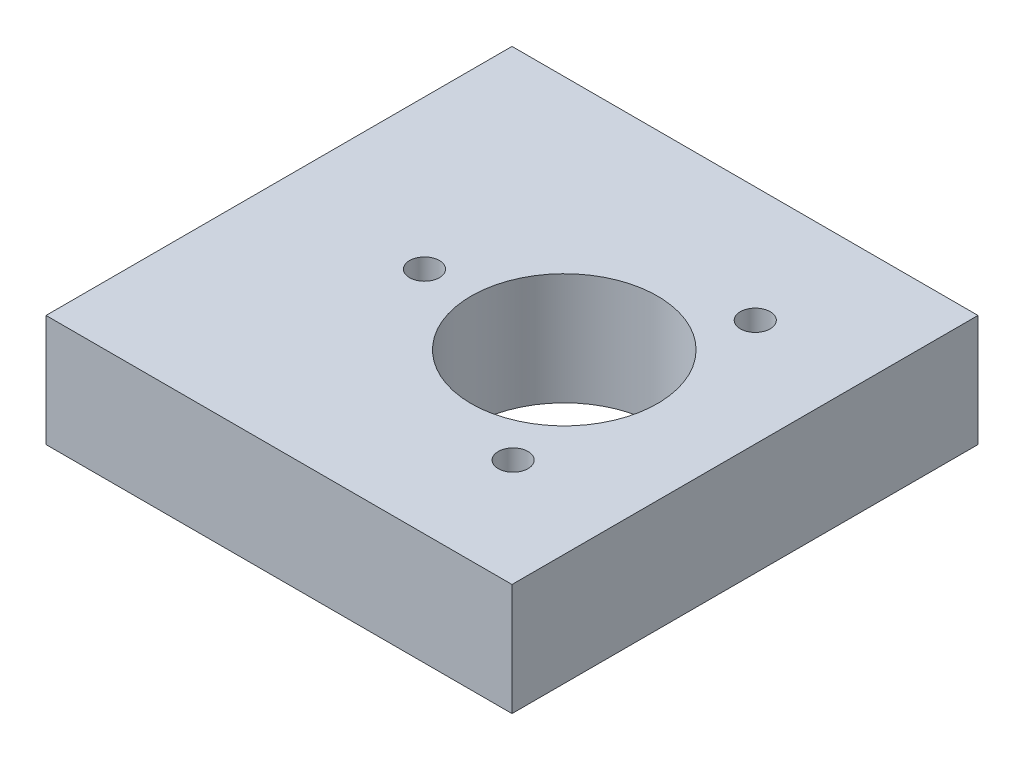
ISO-10303-21;
HEADER;
FILE_DESCRIPTION(('STEP AP214'),'2;1');
FILE_NAME('part.step','',(''),(''),'','','');
FILE_SCHEMA(('AUTOMOTIVE_DESIGN { 1 0 10303 214 1 1 1 1 }'));
ENDSEC;
DATA;
#1=APPLICATION_CONTEXT('core data for automotive mechanical design processes');
#2=APPLICATION_PROTOCOL_DEFINITION('international standard','automotive_design',2000,#1);
#3=PRODUCT_CONTEXT('',#1,'mechanical');
#4=PRODUCT('Part','Part','',(#3));
#5=PRODUCT_RELATED_PRODUCT_CATEGORY('part','',(#4));
#6=PRODUCT_DEFINITION_FORMATION('','',#4);
#7=PRODUCT_DEFINITION_CONTEXT('part definition',#1,'design');
#8=PRODUCT_DEFINITION('design','',#6,#7);
#9=PRODUCT_DEFINITION_SHAPE('','',#8);
#10=(LENGTH_UNIT() NAMED_UNIT(*) SI_UNIT(.MILLI.,.METRE.));
#11=(NAMED_UNIT(*) PLANE_ANGLE_UNIT() SI_UNIT($,.RADIAN.));
#12=(NAMED_UNIT(*) SI_UNIT($,.STERADIAN.) SOLID_ANGLE_UNIT());
#13=UNCERTAINTY_MEASURE_WITH_UNIT(LENGTH_MEASURE(1.E-05),#10,'distance_accuracy_value','');
#14=(GEOMETRIC_REPRESENTATION_CONTEXT(3) GLOBAL_UNCERTAINTY_ASSIGNED_CONTEXT((#13)) GLOBAL_UNIT_ASSIGNED_CONTEXT((#10,
#11,#12)) REPRESENTATION_CONTEXT('',''));
#15=CARTESIAN_POINT('',(0.,0.,0.));
#16=DIRECTION('',(0.,0.,1.));
#17=DIRECTION('',(1.,0.,0.));
#18=AXIS2_PLACEMENT_3D('',#15,#16,#17);
#19=CARTESIAN_POINT('',(-26.4741424256875,-1.92570497536162,50.));
#20=DIRECTION('',(1.,0.,0.));
#21=DIRECTION('',(0.,1.,0.));
#22=AXIS2_PLACEMENT_3D('',#19,#20,#21);
#23=PLANE('',#22);
#24=DIRECTION('',(0.,-1.,0.));
#25=VECTOR('',#24,1.);
#26=CARTESIAN_POINT('',(-26.4741424256875,-1.92570497536162,0.));
#27=LINE('',#26,#25);
#28=CARTESIAN_POINT('',(-26.4741424256875,-1.92570497536162,0.));
#29=VERTEX_POINT('',#28);
#30=CARTESIAN_POINT('',(-26.4741424256875,-13.9257049753616,0.));
#31=VERTEX_POINT('',#30);
#32=EDGE_CURVE('E129',#29,#31,#27,.T.);
#33=ORIENTED_EDGE('',*,*,#32,.T.);
#34=DIRECTION('',(0.,0.,-1.));
#35=VECTOR('',#34,1.);
#36=CARTESIAN_POINT('',(-26.4741424256875,-13.9257049753616,50.));
#37=LINE('',#36,#35);
#38=CARTESIAN_POINT('',(-26.4741424256875,-13.9257049753616,50.));
#39=VERTEX_POINT('',#38);
#40=EDGE_CURVE('E11',#39,#31,#37,.T.);
#41=ORIENTED_EDGE('',*,*,#40,.F.);
#42=DIRECTION('',(0.,-1.,0.));
#43=VECTOR('',#42,1.);
#44=CARTESIAN_POINT('',(-26.4741424256875,-1.92570497536162,50.));
#45=LINE('',#44,#43);
#46=CARTESIAN_POINT('',(-26.4741424256875,-1.92570497536162,50.));
#47=VERTEX_POINT('',#46);
#48=EDGE_CURVE('E130',#47,#39,#45,.T.);
#49=ORIENTED_EDGE('',*,*,#48,.F.);
#50=DIRECTION('',(0.,0.,-1.));
#51=VECTOR('',#50,1.);
#52=CARTESIAN_POINT('',(-26.4741424256875,-1.92570497536162,50.));
#53=LINE('',#52,#51);
#54=EDGE_CURVE('E140',#47,#29,#53,.T.);
#55=ORIENTED_EDGE('',*,*,#54,.T.);
#56=EDGE_LOOP('',(#33,#41,#49,#55));
#57=FACE_BOUND('',#56,.T.);
#58=ADVANCED_FACE('F44',(#57),#23,.F.);
#59=CARTESIAN_POINT('',(-26.4741424256875,-13.9257049753616,50.));
#60=DIRECTION('',(0.,1.,0.));
#61=DIRECTION('',(0.,0.,1.));
#62=AXIS2_PLACEMENT_3D('',#59,#60,#61);
#63=PLANE('',#62);
#64=CARTESIAN_POINT('',(-10.4741424256875,-13.9257049753616,25.3894452392306));
#65=DIRECTION('',(0.,1.,0.));
#66=DIRECTION('',(0.,0.,1.));
#67=AXIS2_PLACEMENT_3D('',#64,#65,#66);
#68=CIRCLE('',#67,1.6);
#69=CARTESIAN_POINT('',(-10.4741424256875,-13.9257049753616,26.9894452392306));
#70=VERTEX_POINT('',#69);
#71=EDGE_CURVE('E122',#70,#70,#68,.T.);
#72=ORIENTED_EDGE('',*,*,#71,.T.);
#73=EDGE_LOOP('',(#72));
#74=FACE_BOUND('',#73,.T.);
#75=CARTESIAN_POINT('',(12.0258575743125,-13.9257049753616,38.3798262959972));
#76=DIRECTION('',(0.,1.,0.));
#77=DIRECTION('',(0.,0.,1.));
#78=AXIS2_PLACEMENT_3D('',#75,#76,#77);
#79=CIRCLE('',#78,1.6);
#80=CARTESIAN_POINT('',(12.0258575743125,-13.9257049753616,39.9798262959972));
#81=VERTEX_POINT('',#80);
#82=EDGE_CURVE('E193',#81,#81,#79,.T.);
#83=ORIENTED_EDGE('',*,*,#82,.T.);
#84=EDGE_LOOP('',(#83));
#85=FACE_BOUND('',#84,.T.);
#86=CARTESIAN_POINT('',(12.0258575743125,-13.9257049753616,12.399064182464));
#87=DIRECTION('',(0.,1.,0.));
#88=DIRECTION('',(0.,0.,1.));
#89=AXIS2_PLACEMENT_3D('',#86,#87,#88);
#90=CIRCLE('',#89,1.6);
#91=CARTESIAN_POINT('',(12.0258575743125,-13.9257049753616,13.999064182464));
#92=VERTEX_POINT('',#91);
#93=EDGE_CURVE('E197',#92,#92,#90,.T.);
#94=ORIENTED_EDGE('',*,*,#93,.T.);
#95=EDGE_LOOP('',(#94));
#96=FACE_BOUND('',#95,.T.);
#97=CARTESIAN_POINT('',(4.52585757431251,-13.9257049753616,25.3894452392306));
#98=DIRECTION('',(0.,1.,0.));
#99=DIRECTION('',(0.,0.,1.));
#100=AXIS2_PLACEMENT_3D('',#97,#98,#99);
#101=CIRCLE('',#100,10.);
#102=CARTESIAN_POINT('',(4.52585757431251,-13.9257049753616,35.3894452392306));
#103=VERTEX_POINT('',#102);
#104=EDGE_CURVE('E200',#103,#103,#101,.T.);
#105=ORIENTED_EDGE('',*,*,#104,.T.);
#106=EDGE_LOOP('',(#105));
#107=FACE_BOUND('',#106,.T.);
#108=DIRECTION('',(1.,0.,0.));
#109=VECTOR('',#108,1.);
#110=CARTESIAN_POINT('',(-26.4741424256875,-13.9257049753616,0.));
#111=LINE('',#110,#109);
#112=CARTESIAN_POINT('',(23.5258575743125,-13.9257049753616,0.));
#113=VERTEX_POINT('',#112);
#114=EDGE_CURVE('E144',#31,#113,#111,.T.);
#115=ORIENTED_EDGE('',*,*,#114,.T.);
#116=DIRECTION('',(0.,0.,-1.));
#117=VECTOR('',#116,1.);
#118=CARTESIAN_POINT('',(23.5258575743125,-13.9257049753616,50.));
#119=LINE('',#118,#117);
#120=CARTESIAN_POINT('',(23.5258575743125,-13.9257049753616,50.));
#121=VERTEX_POINT('',#120);
#122=EDGE_CURVE('E53',#121,#113,#119,.T.);
#123=ORIENTED_EDGE('',*,*,#122,.F.);
#124=DIRECTION('',(1.,0.,0.));
#125=VECTOR('',#124,1.);
#126=CARTESIAN_POINT('',(-26.4741424256875,-13.9257049753616,50.));
#127=LINE('',#126,#125);
#128=EDGE_CURVE('E92',#39,#121,#127,.T.);
#129=ORIENTED_EDGE('',*,*,#128,.F.);
#130=ORIENTED_EDGE('',*,*,#40,.T.);
#131=EDGE_LOOP('',(#115,#123,#129,#130));
#132=FACE_BOUND('',#131,.T.);
#133=ADVANCED_FACE('F175',(#74,#85,#96,#107,#132),#63,.F.);
#134=CARTESIAN_POINT('',(23.5258575743125,-1.92570497536162,50.));
#135=DIRECTION('',(-1.,0.,0.));
#136=DIRECTION('',(0.,-1.,0.));
#137=AXIS2_PLACEMENT_3D('',#134,#135,#136);
#138=PLANE('',#137);
#139=DIRECTION('',(0.,1.,0.));
#140=VECTOR('',#139,1.);
#141=CARTESIAN_POINT('',(23.5258575743125,-1.92570497536162,0.));
#142=LINE('',#141,#140);
#143=CARTESIAN_POINT('',(23.5258575743125,-1.92570497536162,0.));
#144=VERTEX_POINT('',#143);
#145=EDGE_CURVE('E79',#113,#144,#142,.T.);
#146=ORIENTED_EDGE('',*,*,#145,.T.);
#147=DIRECTION('',(0.,0.,-1.));
#148=VECTOR('',#147,1.);
#149=CARTESIAN_POINT('',(23.5258575743125,-1.92570497536162,50.));
#150=LINE('',#149,#148);
#151=CARTESIAN_POINT('',(23.5258575743125,-1.92570497536162,50.));
#152=VERTEX_POINT('',#151);
#153=EDGE_CURVE('E152',#152,#144,#150,.T.);
#154=ORIENTED_EDGE('',*,*,#153,.F.);
#155=DIRECTION('',(0.,1.,0.));
#156=VECTOR('',#155,1.);
#157=CARTESIAN_POINT('',(23.5258575743125,-1.92570497536162,50.));
#158=LINE('',#157,#156);
#159=EDGE_CURVE('E135',#121,#152,#158,.T.);
#160=ORIENTED_EDGE('',*,*,#159,.F.);
#161=ORIENTED_EDGE('',*,*,#122,.T.);
#162=EDGE_LOOP('',(#146,#154,#160,#161));
#163=FACE_BOUND('',#162,.T.);
#164=ADVANCED_FACE('F158',(#163),#138,.F.);
#165=CARTESIAN_POINT('',(-26.4741424256875,-1.92570497536162,50.));
#166=DIRECTION('',(0.,-1.,0.));
#167=DIRECTION('',(0.,0.,-1.));
#168=AXIS2_PLACEMENT_3D('',#165,#166,#167);
#169=PLANE('',#168);
#170=CARTESIAN_POINT('',(-10.4741424256875,-1.92570497536162,25.3894452392306));
#171=DIRECTION('',(0.,1.,0.));
#172=DIRECTION('',(0.,0.,1.));
#173=AXIS2_PLACEMENT_3D('',#170,#171,#172);
#174=CIRCLE('',#173,1.6);
#175=CARTESIAN_POINT('',(-10.4741424256875,-1.92570497536162,26.9894452392306));
#176=VERTEX_POINT('',#175);
#177=EDGE_CURVE('E228',#176,#176,#174,.T.);
#178=ORIENTED_EDGE('',*,*,#177,.F.);
#179=EDGE_LOOP('',(#178));
#180=FACE_BOUND('',#179,.T.);
#181=CARTESIAN_POINT('',(12.0258575743125,-1.92570497536162,38.3798262959972));
#182=DIRECTION('',(0.,1.,0.));
#183=DIRECTION('',(0.,0.,1.));
#184=AXIS2_PLACEMENT_3D('',#181,#182,#183);
#185=CIRCLE('',#184,1.6);
#186=CARTESIAN_POINT('',(12.0258575743125,-1.92570497536162,39.9798262959972));
#187=VERTEX_POINT('',#186);
#188=EDGE_CURVE('E231',#187,#187,#185,.T.);
#189=ORIENTED_EDGE('',*,*,#188,.F.);
#190=EDGE_LOOP('',(#189));
#191=FACE_BOUND('',#190,.T.);
#192=CARTESIAN_POINT('',(12.0258575743125,-1.92570497536162,12.399064182464));
#193=DIRECTION('',(0.,1.,0.));
#194=DIRECTION('',(0.,0.,1.));
#195=AXIS2_PLACEMENT_3D('',#192,#193,#194);
#196=CIRCLE('',#195,1.6);
#197=CARTESIAN_POINT('',(12.0258575743125,-1.92570497536162,13.999064182464));
#198=VERTEX_POINT('',#197);
#199=EDGE_CURVE('E210',#198,#198,#196,.T.);
#200=ORIENTED_EDGE('',*,*,#199,.F.);
#201=EDGE_LOOP('',(#200));
#202=FACE_BOUND('',#201,.T.);
#203=CARTESIAN_POINT('',(4.52585757431251,-1.92570497536162,25.3894452392306));
#204=DIRECTION('',(0.,1.,0.));
#205=DIRECTION('',(0.,0.,1.));
#206=AXIS2_PLACEMENT_3D('',#203,#204,#205);
#207=CIRCLE('',#206,10.);
#208=CARTESIAN_POINT('',(4.52585757431251,-1.92570497536162,35.3894452392306));
#209=VERTEX_POINT('',#208);
#210=EDGE_CURVE('E203',#209,#209,#207,.T.);
#211=ORIENTED_EDGE('',*,*,#210,.F.);
#212=EDGE_LOOP('',(#211));
#213=FACE_BOUND('',#212,.T.);
#214=DIRECTION('',(-1.,0.,0.));
#215=VECTOR('',#214,1.);
#216=CARTESIAN_POINT('',(-26.4741424256875,-1.92570497536162,0.));
#217=LINE('',#216,#215);
#218=EDGE_CURVE('E85',#144,#29,#217,.T.);
#219=ORIENTED_EDGE('',*,*,#218,.T.);
#220=ORIENTED_EDGE('',*,*,#54,.F.);
#221=DIRECTION('',(-1.,0.,0.));
#222=VECTOR('',#221,1.);
#223=CARTESIAN_POINT('',(-26.4741424256875,-1.92570497536162,50.));
#224=LINE('',#223,#222);
#225=EDGE_CURVE('E61',#152,#47,#224,.T.);
#226=ORIENTED_EDGE('',*,*,#225,.F.);
#227=ORIENTED_EDGE('',*,*,#153,.T.);
#228=EDGE_LOOP('',(#219,#220,#226,#227));
#229=FACE_BOUND('',#228,.T.);
#230=ADVANCED_FACE('F165',(#180,#191,#202,#213,#229),#169,.F.);
#231=CARTESIAN_POINT('',(0.,0.,50.));
#232=DIRECTION('',(0.,0.,1.));
#233=DIRECTION('',(1.,0.,0.));
#234=AXIS2_PLACEMENT_3D('',#231,#232,#233);
#235=PLANE('',#234);
#236=ORIENTED_EDGE('',*,*,#48,.T.);
#237=ORIENTED_EDGE('',*,*,#128,.T.);
#238=ORIENTED_EDGE('',*,*,#159,.T.);
#239=ORIENTED_EDGE('',*,*,#225,.T.);
#240=EDGE_LOOP('',(#236,#237,#238,#239));
#241=FACE_BOUND('',#240,.T.);
#242=ADVANCED_FACE('F167',(#241),#235,.T.);
#243=CARTESIAN_POINT('',(0.,0.,0.));
#244=DIRECTION('',(0.,0.,1.));
#245=DIRECTION('',(1.,0.,0.));
#246=AXIS2_PLACEMENT_3D('',#243,#244,#245);
#247=PLANE('',#246);
#248=CARTESIAN_POINT('',(4.52585757431251,-7.92570497536162,0.));
#249=DIRECTION('',(0.,0.,-1.));
#250=DIRECTION('',(-1.,0.,0.));
#251=AXIS2_PLACEMENT_3D('',#248,#249,#250);
#252=CIRCLE('',#251,1.64999999999999);
#253=CARTESIAN_POINT('',(2.87585757431252,-7.92570497536162,0.));
#254=VERTEX_POINT('',#253);
#255=EDGE_CURVE('E111',#254,#254,#252,.T.);
#256=ORIENTED_EDGE('',*,*,#255,.F.);
#257=EDGE_LOOP('',(#256));
#258=FACE_BOUND('',#257,.T.);
#259=CARTESIAN_POINT('',(-14.4741424256875,-7.92570497536162,0.));
#260=DIRECTION('',(0.,0.,-1.));
#261=DIRECTION('',(-1.,0.,0.));
#262=AXIS2_PLACEMENT_3D('',#259,#260,#261);
#263=CIRCLE('',#262,1.64999999999999);
#264=CARTESIAN_POINT('',(-16.1241424256875,-7.92570497536162,0.));
#265=VERTEX_POINT('',#264);
#266=EDGE_CURVE('E110',#265,#265,#263,.T.);
#267=ORIENTED_EDGE('',*,*,#266,.F.);
#268=EDGE_LOOP('',(#267));
#269=FACE_BOUND('',#268,.T.);
#270=ORIENTED_EDGE('',*,*,#32,.F.);
#271=ORIENTED_EDGE('',*,*,#218,.F.);
#272=ORIENTED_EDGE('',*,*,#145,.F.);
#273=ORIENTED_EDGE('',*,*,#114,.F.);
#274=EDGE_LOOP('',(#270,#271,#272,#273));
#275=FACE_BOUND('',#274,.T.);
#276=ADVANCED_FACE('F161',(#258,#269,#275),#247,.F.);
#277=CARTESIAN_POINT('',(-14.4741424256875,-7.92570497536162,10.1));
#278=DIRECTION('',(0.,0.,-1.));
#279=DIRECTION('',(-1.,0.,0.));
#280=AXIS2_PLACEMENT_3D('',#277,#278,#279);
#281=CONICAL_SURFACE('',#280,1.64999999999999,1.02974425867665);
#282=CARTESIAN_POINT('',(-14.4741424256875,-7.92570497536162,11.0914200213955));
#283=VERTEX_POINT('',#282);
#284=VERTEX_LOOP('',#283);
#285=FACE_BOUND('',#284,.T.);
#286=CARTESIAN_POINT('',(-14.4741424256875,-7.92570497536162,10.1));
#287=DIRECTION('',(0.,0.,-1.));
#288=DIRECTION('',(-1.,0.,0.));
#289=AXIS2_PLACEMENT_3D('',#286,#287,#288);
#290=CIRCLE('',#289,1.64999999999999);
#291=CARTESIAN_POINT('',(-16.1241424256875,-7.92570497536162,10.1));
#292=VERTEX_POINT('',#291);
#293=EDGE_CURVE('E118',#292,#292,#290,.T.);
#294=ORIENTED_EDGE('',*,*,#293,.T.);
#295=EDGE_LOOP('',(#294));
#296=FACE_BOUND('',#295,.T.);
#297=ADVANCED_FACE('F269',(#285,#296),#281,.F.);
#298=CARTESIAN_POINT('',(-14.4741424256875,-7.92570497536162,0.));
#299=DIRECTION('',(0.,0.,-1.));
#300=DIRECTION('',(-1.,0.,0.));
#301=AXIS2_PLACEMENT_3D('',#298,#299,#300);
#302=CYLINDRICAL_SURFACE('',#301,1.64999999999999);
#303=ORIENTED_EDGE('',*,*,#293,.F.);
#304=EDGE_LOOP('',(#303));
#305=FACE_BOUND('',#304,.T.);
#306=ORIENTED_EDGE('',*,*,#266,.T.);
#307=EDGE_LOOP('',(#306));
#308=FACE_BOUND('',#307,.T.);
#309=ADVANCED_FACE('F103',(#305,#308),#302,.F.);
#310=CARTESIAN_POINT('',(4.52585757431251,-7.92570497536162,10.1));
#311=DIRECTION('',(0.,0.,-1.));
#312=DIRECTION('',(-1.,0.,0.));
#313=AXIS2_PLACEMENT_3D('',#310,#311,#312);
#314=CONICAL_SURFACE('',#313,1.64999999999999,1.02974425867665);
#315=CARTESIAN_POINT('',(4.52585757431251,-7.92570497536162,11.0914200213955));
#316=VERTEX_POINT('',#315);
#317=VERTEX_LOOP('',#316);
#318=FACE_BOUND('',#317,.T.);
#319=CARTESIAN_POINT('',(4.52585757431251,-7.92570497536162,10.1));
#320=DIRECTION('',(0.,0.,-1.));
#321=DIRECTION('',(-1.,0.,0.));
#322=AXIS2_PLACEMENT_3D('',#319,#320,#321);
#323=CIRCLE('',#322,1.64999999999999);
#324=CARTESIAN_POINT('',(2.87585757431252,-7.92570497536162,10.1));
#325=VERTEX_POINT('',#324);
#326=EDGE_CURVE('E107',#325,#325,#323,.T.);
#327=ORIENTED_EDGE('',*,*,#326,.T.);
#328=EDGE_LOOP('',(#327));
#329=FACE_BOUND('',#328,.T.);
#330=ADVANCED_FACE('F99',(#318,#329),#314,.F.);
#331=CARTESIAN_POINT('',(4.52585757431251,-7.92570497536162,0.));
#332=DIRECTION('',(0.,0.,-1.));
#333=DIRECTION('',(-1.,0.,0.));
#334=AXIS2_PLACEMENT_3D('',#331,#332,#333);
#335=CYLINDRICAL_SURFACE('',#334,1.64999999999999);
#336=ORIENTED_EDGE('',*,*,#326,.F.);
#337=EDGE_LOOP('',(#336));
#338=FACE_BOUND('',#337,.T.);
#339=ORIENTED_EDGE('',*,*,#255,.T.);
#340=EDGE_LOOP('',(#339));
#341=FACE_BOUND('',#340,.T.);
#342=ADVANCED_FACE('F102',(#338,#341),#335,.F.);
#343=CARTESIAN_POINT('',(4.52585757431251,-51.9257049753616,25.3894452392306));
#344=DIRECTION('',(0.,1.,0.));
#345=DIRECTION('',(0.,0.,1.));
#346=AXIS2_PLACEMENT_3D('',#343,#344,#345);
#347=CYLINDRICAL_SURFACE('',#346,10.);
#348=ORIENTED_EDGE('',*,*,#210,.T.);
#349=EDGE_LOOP('',(#348));
#350=FACE_BOUND('',#349,.T.);
#351=ORIENTED_EDGE('',*,*,#104,.F.);
#352=EDGE_LOOP('',(#351));
#353=FACE_BOUND('',#352,.T.);
#354=ADVANCED_FACE('F253',(#350,#353),#347,.F.);
#355=CARTESIAN_POINT('',(12.0258575743125,-51.9257049753616,12.399064182464));
#356=DIRECTION('',(0.,1.,0.));
#357=DIRECTION('',(0.,0.,1.));
#358=AXIS2_PLACEMENT_3D('',#355,#356,#357);
#359=CYLINDRICAL_SURFACE('',#358,1.6);
#360=ORIENTED_EDGE('',*,*,#199,.T.);
#361=EDGE_LOOP('',(#360));
#362=FACE_BOUND('',#361,.T.);
#363=ORIENTED_EDGE('',*,*,#93,.F.);
#364=EDGE_LOOP('',(#363));
#365=FACE_BOUND('',#364,.T.);
#366=ADVANCED_FACE('F247',(#362,#365),#359,.F.);
#367=CARTESIAN_POINT('',(12.0258575743125,-51.9257049753616,38.3798262959972));
#368=DIRECTION('',(0.,1.,0.));
#369=DIRECTION('',(0.,0.,1.));
#370=AXIS2_PLACEMENT_3D('',#367,#368,#369);
#371=CYLINDRICAL_SURFACE('',#370,1.6);
#372=ORIENTED_EDGE('',*,*,#188,.T.);
#373=EDGE_LOOP('',(#372));
#374=FACE_BOUND('',#373,.T.);
#375=ORIENTED_EDGE('',*,*,#82,.F.);
#376=EDGE_LOOP('',(#375));
#377=FACE_BOUND('',#376,.T.);
#378=ADVANCED_FACE('F260',(#374,#377),#371,.F.);
#379=CARTESIAN_POINT('',(-10.4741424256875,-51.9257049753616,25.3894452392306));
#380=DIRECTION('',(0.,1.,0.));
#381=DIRECTION('',(0.,0.,1.));
#382=AXIS2_PLACEMENT_3D('',#379,#380,#381);
#383=CYLINDRICAL_SURFACE('',#382,1.6);
#384=ORIENTED_EDGE('',*,*,#177,.T.);
#385=EDGE_LOOP('',(#384));
#386=FACE_BOUND('',#385,.T.);
#387=ORIENTED_EDGE('',*,*,#71,.F.);
#388=EDGE_LOOP('',(#387));
#389=FACE_BOUND('',#388,.T.);
#390=ADVANCED_FACE('F264',(#386,#389),#383,.F.);
#391=CLOSED_SHELL('',(#58,#133,#164,#230,#242,#276,#297,#309,#330,#342,#354,#366,#378,#390));
#392=MANIFOLD_SOLID_BREP('B2',#391);
#393=ADVANCED_BREP_SHAPE_REPRESENTATION('',(#18,#392),#14);
#394=SHAPE_DEFINITION_REPRESENTATION(#9,#393);
ENDSEC;
END-ISO-10303-21;
